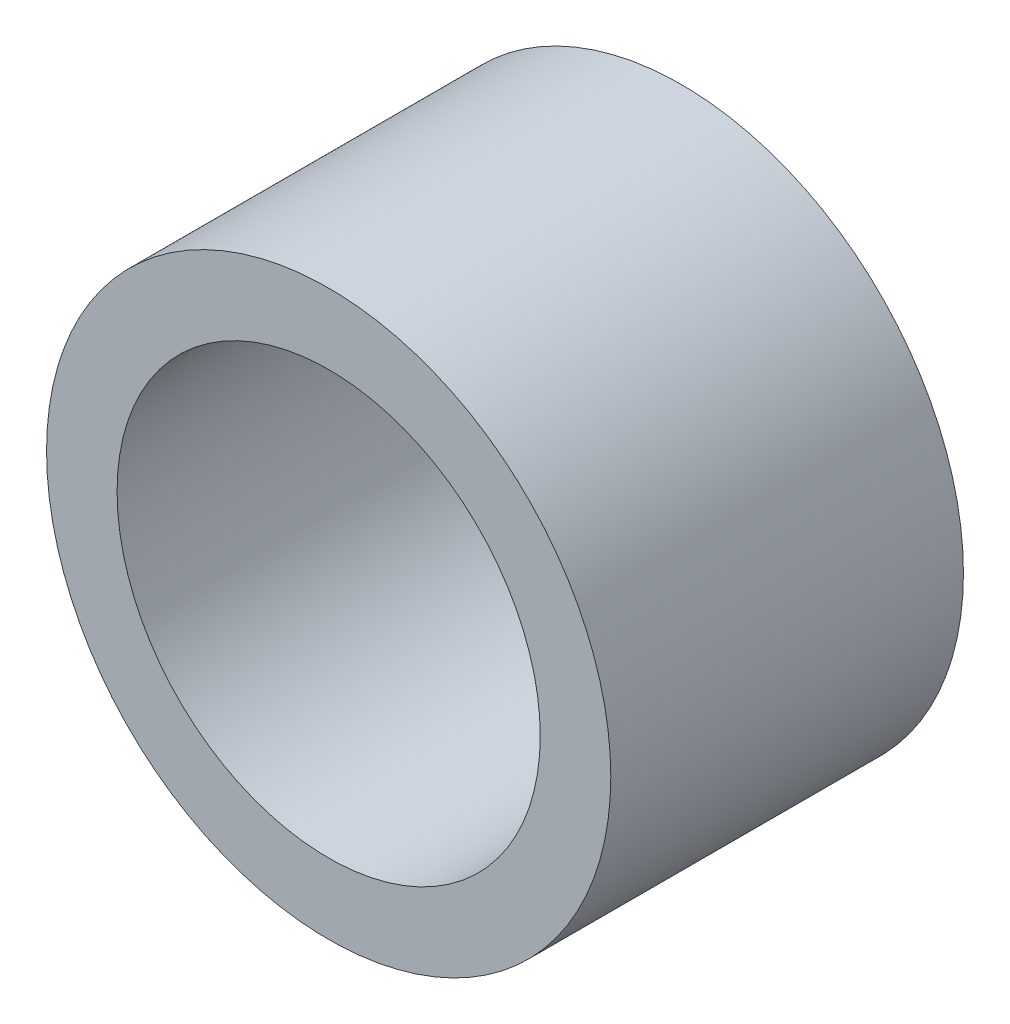
ISO-10303-21;
HEADER;
FILE_DESCRIPTION(('STEP AP214'),'2;1');
FILE_NAME('part.step','',(''),(''),'','','');
FILE_SCHEMA(('AUTOMOTIVE_DESIGN { 1 0 10303 214 1 1 1 1 }'));
ENDSEC;
DATA;
#1=APPLICATION_CONTEXT('core data for automotive mechanical design processes');
#2=APPLICATION_PROTOCOL_DEFINITION('international standard','automotive_design',2000,#1);
#3=PRODUCT_CONTEXT('',#1,'mechanical');
#4=PRODUCT('Part','Part','',(#3));
#5=PRODUCT_RELATED_PRODUCT_CATEGORY('part','',(#4));
#6=PRODUCT_DEFINITION_FORMATION('','',#4);
#7=PRODUCT_DEFINITION_CONTEXT('part definition',#1,'design');
#8=PRODUCT_DEFINITION('design','',#6,#7);
#9=PRODUCT_DEFINITION_SHAPE('','',#8);
#10=(LENGTH_UNIT() NAMED_UNIT(*) SI_UNIT(.MILLI.,.METRE.));
#11=(NAMED_UNIT(*) PLANE_ANGLE_UNIT() SI_UNIT($,.RADIAN.));
#12=(NAMED_UNIT(*) SI_UNIT($,.STERADIAN.) SOLID_ANGLE_UNIT());
#13=UNCERTAINTY_MEASURE_WITH_UNIT(LENGTH_MEASURE(1.E-05),#10,'distance_accuracy_value','');
#14=(GEOMETRIC_REPRESENTATION_CONTEXT(3) GLOBAL_UNCERTAINTY_ASSIGNED_CONTEXT((#13)) GLOBAL_UNIT_ASSIGNED_CONTEXT((#10,
#11,#12)) REPRESENTATION_CONTEXT('',''));
#15=CARTESIAN_POINT('',(0.,0.,0.));
#16=DIRECTION('',(0.,0.,1.));
#17=DIRECTION('',(1.,0.,0.));
#18=AXIS2_PLACEMENT_3D('',#15,#16,#17);
#19=CARTESIAN_POINT('',(0.,0.,5.));
#20=DIRECTION('',(0.,0.,1.));
#21=DIRECTION('',(1.,0.,0.));
#22=AXIS2_PLACEMENT_3D('',#19,#20,#21);
#23=PLANE('',#22);
#24=CARTESIAN_POINT('',(0.,0.,5.));
#25=DIRECTION('',(0.,0.,1.));
#26=DIRECTION('',(1.,0.,0.));
#27=AXIS2_PLACEMENT_3D('',#24,#25,#26);
#28=CIRCLE('',#27,4.);
#29=CARTESIAN_POINT('',(4.,0.,5.));
#30=VERTEX_POINT('',#29);
#31=EDGE_CURVE('E10',#30,#30,#28,.T.);
#32=ORIENTED_EDGE('',*,*,#31,.T.);
#33=EDGE_LOOP('',(#32));
#34=FACE_BOUND('',#33,.T.);
#35=CARTESIAN_POINT('',(0.,0.,5.));
#36=DIRECTION('',(0.,0.,1.));
#37=DIRECTION('',(1.,0.,0.));
#38=AXIS2_PLACEMENT_3D('',#35,#36,#37);
#39=CIRCLE('',#38,3.);
#40=CARTESIAN_POINT('',(3.,0.,5.));
#41=VERTEX_POINT('',#40);
#42=EDGE_CURVE('E44',#41,#41,#39,.T.);
#43=ORIENTED_EDGE('',*,*,#42,.F.);
#44=EDGE_LOOP('',(#43));
#45=FACE_BOUND('',#44,.T.);
#46=ADVANCED_FACE('F33',(#34,#45),#23,.T.);
#47=CARTESIAN_POINT('',(0.,0.,0.));
#48=DIRECTION('',(0.,0.,1.));
#49=DIRECTION('',(1.,0.,0.));
#50=AXIS2_PLACEMENT_3D('',#47,#48,#49);
#51=PLANE('',#50);
#52=CARTESIAN_POINT('',(0.,0.,0.));
#53=DIRECTION('',(0.,0.,1.));
#54=DIRECTION('',(1.,0.,0.));
#55=AXIS2_PLACEMENT_3D('',#52,#53,#54);
#56=CIRCLE('',#55,4.);
#57=CARTESIAN_POINT('',(4.,0.,0.));
#58=VERTEX_POINT('',#57);
#59=EDGE_CURVE('E37',#58,#58,#56,.T.);
#60=ORIENTED_EDGE('',*,*,#59,.F.);
#61=EDGE_LOOP('',(#60));
#62=FACE_BOUND('',#61,.T.);
#63=CARTESIAN_POINT('',(0.,0.,0.));
#64=DIRECTION('',(0.,0.,1.));
#65=DIRECTION('',(1.,0.,0.));
#66=AXIS2_PLACEMENT_3D('',#63,#64,#65);
#67=CIRCLE('',#66,3.);
#68=CARTESIAN_POINT('',(3.,0.,0.));
#69=VERTEX_POINT('',#68);
#70=EDGE_CURVE('E46',#69,#69,#67,.T.);
#71=ORIENTED_EDGE('',*,*,#70,.T.);
#72=EDGE_LOOP('',(#71));
#73=FACE_BOUND('',#72,.T.);
#74=ADVANCED_FACE('F56',(#62,#73),#51,.F.);
#75=CARTESIAN_POINT('',(0.,0.,5.));
#76=DIRECTION('',(0.,0.,-1.));
#77=DIRECTION('',(-1.,0.,0.));
#78=AXIS2_PLACEMENT_3D('',#75,#76,#77);
#79=CYLINDRICAL_SURFACE('',#78,4.);
#80=ORIENTED_EDGE('',*,*,#31,.F.);
#81=EDGE_LOOP('',(#80));
#82=FACE_BOUND('',#81,.T.);
#83=ORIENTED_EDGE('',*,*,#59,.T.);
#84=EDGE_LOOP('',(#83));
#85=FACE_BOUND('',#84,.T.);
#86=ADVANCED_FACE('F35',(#82,#85),#79,.T.);
#87=CARTESIAN_POINT('',(0.,0.,5.));
#88=DIRECTION('',(0.,0.,-1.));
#89=DIRECTION('',(-1.,0.,0.));
#90=AXIS2_PLACEMENT_3D('',#87,#88,#89);
#91=CYLINDRICAL_SURFACE('',#90,3.);
#92=ORIENTED_EDGE('',*,*,#42,.T.);
#93=EDGE_LOOP('',(#92));
#94=FACE_BOUND('',#93,.T.);
#95=ORIENTED_EDGE('',*,*,#70,.F.);
#96=EDGE_LOOP('',(#95));
#97=FACE_BOUND('',#96,.T.);
#98=ADVANCED_FACE('F52',(#94,#97),#91,.F.);
#99=CLOSED_SHELL('',(#46,#74,#86,#98));
#100=MANIFOLD_SOLID_BREP('B2',#99);
#101=ADVANCED_BREP_SHAPE_REPRESENTATION('',(#18,#100),#14);
#102=SHAPE_DEFINITION_REPRESENTATION(#9,#101);
ENDSEC;
END-ISO-10303-21;
